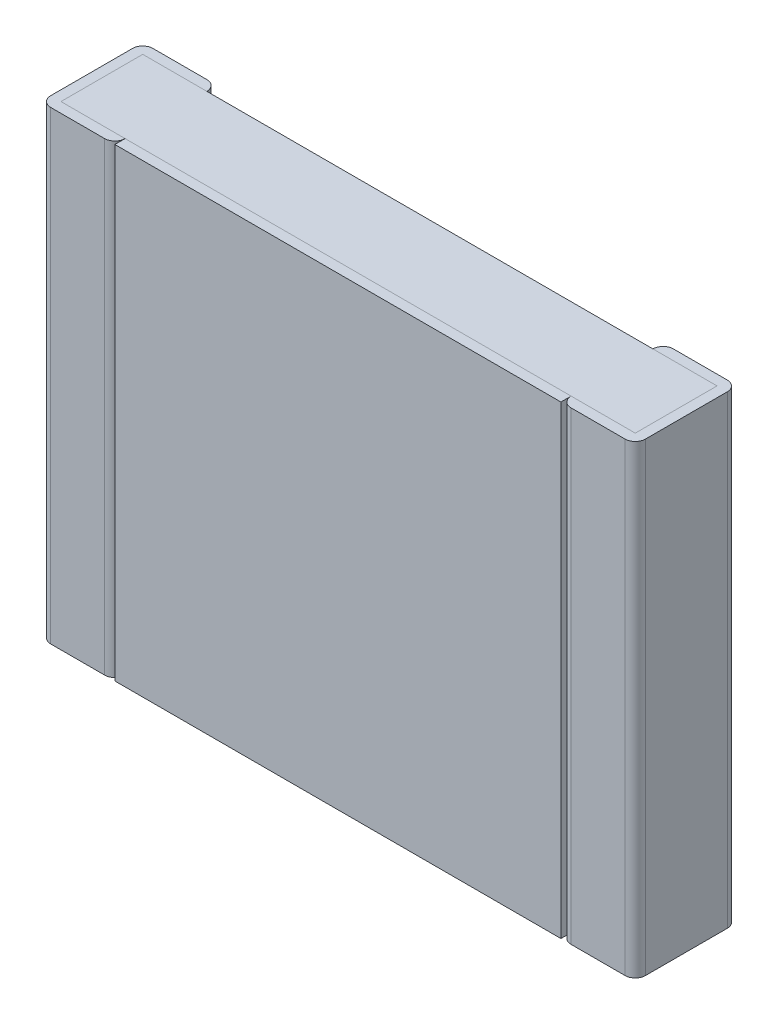
ISO-10303-21;
HEADER;
FILE_DESCRIPTION(('STEP AP214'),'2;1');
FILE_NAME('part.step','',(''),(''),'','','');
FILE_SCHEMA(('AUTOMOTIVE_DESIGN { 1 0 10303 214 1 1 1 1 }'));
ENDSEC;
DATA;
#1=APPLICATION_CONTEXT('core data for automotive mechanical design processes');
#2=APPLICATION_PROTOCOL_DEFINITION('international standard','automotive_design',2000,#1);
#3=PRODUCT_CONTEXT('',#1,'mechanical');
#4=PRODUCT('Part','Part','',(#3));
#5=PRODUCT_RELATED_PRODUCT_CATEGORY('part','',(#4));
#6=PRODUCT_DEFINITION_FORMATION('','',#4);
#7=PRODUCT_DEFINITION_CONTEXT('part definition',#1,'design');
#8=PRODUCT_DEFINITION('design','',#6,#7);
#9=PRODUCT_DEFINITION_SHAPE('','',#8);
#10=(LENGTH_UNIT() NAMED_UNIT(*) SI_UNIT(.MILLI.,.METRE.));
#11=(NAMED_UNIT(*) PLANE_ANGLE_UNIT() SI_UNIT($,.RADIAN.));
#12=(NAMED_UNIT(*) SI_UNIT($,.STERADIAN.) SOLID_ANGLE_UNIT());
#13=UNCERTAINTY_MEASURE_WITH_UNIT(LENGTH_MEASURE(1.E-05),#10,'distance_accuracy_value','');
#14=(GEOMETRIC_REPRESENTATION_CONTEXT(3) GLOBAL_UNCERTAINTY_ASSIGNED_CONTEXT((#13)) GLOBAL_UNIT_ASSIGNED_CONTEXT((#10,
#11,#12)) REPRESENTATION_CONTEXT('',''));
#15=CARTESIAN_POINT('',(0.,0.,0.));
#16=DIRECTION('',(0.,0.,1.));
#17=DIRECTION('',(1.,0.,0.));
#18=AXIS2_PLACEMENT_3D('',#15,#16,#17);
#19=CARTESIAN_POINT('',(-1.2,-1.25,0.55));
#20=DIRECTION('',(0.,0.,1.));
#21=DIRECTION('',(1.,0.,0.));
#22=AXIS2_PLACEMENT_3D('',#19,#20,#21);
#23=PLANE('',#22);
#24=DIRECTION('',(0.,1.,0.));
#25=VECTOR('',#24,1.);
#26=CARTESIAN_POINT('',(-1.2,-1.25,0.55));
#27=LINE('',#26,#25);
#28=CARTESIAN_POINT('',(-1.2,-1.25,0.55));
#29=VERTEX_POINT('',#28);
#30=CARTESIAN_POINT('',(-1.2,1.25,0.55));
#31=VERTEX_POINT('',#30);
#32=EDGE_CURVE('E357',#29,#31,#27,.T.);
#33=ORIENTED_EDGE('',*,*,#32,.F.);
#34=DIRECTION('',(1.,0.,0.));
#35=VECTOR('',#34,1.);
#36=CARTESIAN_POINT('',(-1.2,-1.25,0.55));
#37=LINE('',#36,#35);
#38=CARTESIAN_POINT('',(1.2,-1.25,0.55));
#39=VERTEX_POINT('',#38);
#40=EDGE_CURVE('E365',#29,#39,#37,.T.);
#41=ORIENTED_EDGE('',*,*,#40,.T.);
#42=DIRECTION('',(0.,1.,0.));
#43=VECTOR('',#42,1.);
#44=CARTESIAN_POINT('',(1.2,-1.25,0.55));
#45=LINE('',#44,#43);
#46=CARTESIAN_POINT('',(1.2,1.25,0.55));
#47=VERTEX_POINT('',#46);
#48=EDGE_CURVE('E11',#39,#47,#45,.T.);
#49=ORIENTED_EDGE('',*,*,#48,.T.);
#50=DIRECTION('',(1.,0.,0.));
#51=VECTOR('',#50,1.);
#52=CARTESIAN_POINT('',(-1.2,1.25,0.55));
#53=LINE('',#52,#51);
#54=EDGE_CURVE('E346',#31,#47,#53,.T.);
#55=ORIENTED_EDGE('',*,*,#54,.F.);
#56=EDGE_LOOP('',(#33,#41,#49,#55));
#57=FACE_BOUND('',#56,.T.);
#58=ADVANCED_FACE('F16',(#57),#23,.T.);
#59=CARTESIAN_POINT('',(1.2,-1.25,0.495));
#60=DIRECTION('',(1.,0.,0.));
#61=DIRECTION('',(0.,1.,0.));
#62=AXIS2_PLACEMENT_3D('',#59,#60,#61);
#63=PLANE('',#62);
#64=DIRECTION('',(0.,0.,1.));
#65=VECTOR('',#64,1.);
#66=CARTESIAN_POINT('',(1.2,-1.25,0.495));
#67=LINE('',#66,#65);
#68=CARTESIAN_POINT('',(1.2,-1.25,0.495));
#69=VERTEX_POINT('',#68);
#70=EDGE_CURVE('E361',#69,#39,#67,.T.);
#71=ORIENTED_EDGE('',*,*,#70,.F.);
#72=DIRECTION('',(0.,1.,0.));
#73=VECTOR('',#72,1.);
#74=CARTESIAN_POINT('',(1.2,-1.25,0.495));
#75=LINE('',#74,#73);
#76=CARTESIAN_POINT('',(1.2,1.25,0.495));
#77=VERTEX_POINT('',#76);
#78=EDGE_CURVE('E27',#69,#77,#75,.T.);
#79=ORIENTED_EDGE('',*,*,#78,.T.);
#80=DIRECTION('',(0.,0.,1.));
#81=VECTOR('',#80,1.);
#82=CARTESIAN_POINT('',(1.2,1.25,0.495));
#83=LINE('',#82,#81);
#84=EDGE_CURVE('E350',#77,#47,#83,.T.);
#85=ORIENTED_EDGE('',*,*,#84,.T.);
#86=ORIENTED_EDGE('',*,*,#48,.F.);
#87=EDGE_LOOP('',(#71,#79,#85,#86));
#88=FACE_BOUND('',#87,.T.);
#89=ADVANCED_FACE('F511',(#88),#63,.T.);
#90=CARTESIAN_POINT('',(1.255,-1.25,0.495));
#91=DIRECTION('',(0.,1.,0.));
#92=DIRECTION('',(-1.,0.,0.));
#93=AXIS2_PLACEMENT_3D('',#90,#91,#92);
#94=CYLINDRICAL_SURFACE('',#93,0.055);
#95=CARTESIAN_POINT('',(1.255,-1.25,0.495));
#96=DIRECTION('',(0.,1.,0.));
#97=DIRECTION('',(0.,0.,1.));
#98=AXIS2_PLACEMENT_3D('',#95,#96,#97);
#99=CIRCLE('',#98,0.055);
#100=CARTESIAN_POINT('',(1.255,-1.25,0.55));
#101=VERTEX_POINT('',#100);
#102=EDGE_CURVE('E247',#69,#101,#99,.T.);
#103=ORIENTED_EDGE('',*,*,#102,.T.);
#104=DIRECTION('',(0.,1.,0.));
#105=VECTOR('',#104,1.);
#106=CARTESIAN_POINT('',(1.255,-1.25,0.55));
#107=LINE('',#106,#105);
#108=CARTESIAN_POINT('',(1.255,1.25,0.55));
#109=VERTEX_POINT('',#108);
#110=EDGE_CURVE('E241',#101,#109,#107,.T.);
#111=ORIENTED_EDGE('',*,*,#110,.T.);
#112=CARTESIAN_POINT('',(1.255,1.25,0.495));
#113=DIRECTION('',(0.,1.,0.));
#114=DIRECTION('',(0.,0.,1.));
#115=AXIS2_PLACEMENT_3D('',#112,#113,#114);
#116=CIRCLE('',#115,0.055);
#117=EDGE_CURVE('E259',#77,#109,#116,.T.);
#118=ORIENTED_EDGE('',*,*,#117,.F.);
#119=ORIENTED_EDGE('',*,*,#78,.F.);
#120=EDGE_LOOP('',(#103,#111,#118,#119));
#121=FACE_BOUND('',#120,.T.);
#122=ADVANCED_FACE('F18',(#121),#94,.T.);
#123=CARTESIAN_POINT('',(1.2,-1.25,0.55));
#124=DIRECTION('',(0.,0.,1.));
#125=DIRECTION('',(1.,0.,0.));
#126=AXIS2_PLACEMENT_3D('',#123,#124,#125);
#127=PLANE('',#126);
#128=DIRECTION('',(1.,0.,0.));
#129=VECTOR('',#128,1.);
#130=CARTESIAN_POINT('',(1.2,1.25,0.55));
#131=LINE('',#130,#129);
#132=CARTESIAN_POINT('',(1.545,1.25,0.55));
#133=VERTEX_POINT('',#132);
#134=EDGE_CURVE('E255',#109,#133,#131,.T.);
#135=ORIENTED_EDGE('',*,*,#134,.F.);
#136=ORIENTED_EDGE('',*,*,#110,.F.);
#137=DIRECTION('',(1.,0.,0.));
#138=VECTOR('',#137,1.);
#139=CARTESIAN_POINT('',(1.2,-1.25,0.55));
#140=LINE('',#139,#138);
#141=CARTESIAN_POINT('',(1.545,-1.25,0.55));
#142=VERTEX_POINT('',#141);
#143=EDGE_CURVE('E243',#101,#142,#140,.T.);
#144=ORIENTED_EDGE('',*,*,#143,.T.);
#145=DIRECTION('',(0.,1.,0.));
#146=VECTOR('',#145,1.);
#147=CARTESIAN_POINT('',(1.545,-1.25,0.55));
#148=LINE('',#147,#146);
#149=EDGE_CURVE('E262',#142,#133,#148,.T.);
#150=ORIENTED_EDGE('',*,*,#149,.T.);
#151=EDGE_LOOP('',(#135,#136,#144,#150));
#152=FACE_BOUND('',#151,.T.);
#153=ADVANCED_FACE('F510',(#152),#127,.T.);
#154=CARTESIAN_POINT('',(1.545,-1.25,0.495));
#155=DIRECTION('',(0.,1.,0.));
#156=DIRECTION('',(1.,0.,0.));
#157=AXIS2_PLACEMENT_3D('',#154,#155,#156);
#158=CYLINDRICAL_SURFACE('',#157,0.055);
#159=DIRECTION('',(0.,1.,0.));
#160=VECTOR('',#159,1.);
#161=CARTESIAN_POINT('',(1.6,-1.25,0.495));
#162=LINE('',#161,#160);
#163=CARTESIAN_POINT('',(1.6,-1.25,0.495));
#164=VERTEX_POINT('',#163);
#165=CARTESIAN_POINT('',(1.6,1.25,0.495));
#166=VERTEX_POINT('',#165);
#167=EDGE_CURVE('E353',#164,#166,#162,.T.);
#168=ORIENTED_EDGE('',*,*,#167,.T.);
#169=CARTESIAN_POINT('',(1.545,1.25,0.495));
#170=DIRECTION('',(0.,-1.,0.));
#171=DIRECTION('',(0.,0.,1.));
#172=AXIS2_PLACEMENT_3D('',#169,#170,#171);
#173=CIRCLE('',#172,0.055);
#174=EDGE_CURVE('E233',#166,#133,#173,.T.);
#175=ORIENTED_EDGE('',*,*,#174,.T.);
#176=ORIENTED_EDGE('',*,*,#149,.F.);
#177=CARTESIAN_POINT('',(1.545,-1.25,0.495));
#178=DIRECTION('',(0.,-1.,0.));
#179=DIRECTION('',(0.,0.,1.));
#180=AXIS2_PLACEMENT_3D('',#177,#178,#179);
#181=CIRCLE('',#180,0.055);
#182=EDGE_CURVE('E248',#164,#142,#181,.T.);
#183=ORIENTED_EDGE('',*,*,#182,.F.);
#184=EDGE_LOOP('',(#168,#175,#176,#183));
#185=FACE_BOUND('',#184,.T.);
#186=ADVANCED_FACE('F535',(#185),#158,.T.);
#187=CARTESIAN_POINT('',(1.6,-1.25,0.));
#188=DIRECTION('',(1.,0.,0.));
#189=DIRECTION('',(0.,1.,0.));
#190=AXIS2_PLACEMENT_3D('',#187,#188,#189);
#191=PLANE('',#190);
#192=DIRECTION('',(0.,0.,1.));
#193=VECTOR('',#192,1.);
#194=CARTESIAN_POINT('',(1.6,-1.25,0.));
#195=LINE('',#194,#193);
#196=CARTESIAN_POINT('',(1.6,-1.25,0.055));
#197=VERTEX_POINT('',#196);
#198=EDGE_CURVE('E321',#197,#164,#195,.T.);
#199=ORIENTED_EDGE('',*,*,#198,.F.);
#200=DIRECTION('',(0.,1.,0.));
#201=VECTOR('',#200,1.);
#202=CARTESIAN_POINT('',(1.6,-1.25,0.055));
#203=LINE('',#202,#201);
#204=CARTESIAN_POINT('',(1.6,1.25,0.055));
#205=VERTEX_POINT('',#204);
#206=EDGE_CURVE('E289',#197,#205,#203,.T.);
#207=ORIENTED_EDGE('',*,*,#206,.T.);
#208=DIRECTION('',(0.,0.,1.));
#209=VECTOR('',#208,1.);
#210=CARTESIAN_POINT('',(1.6,1.25,0.));
#211=LINE('',#210,#209);
#212=EDGE_CURVE('E228',#205,#166,#211,.T.);
#213=ORIENTED_EDGE('',*,*,#212,.T.);
#214=ORIENTED_EDGE('',*,*,#167,.F.);
#215=EDGE_LOOP('',(#199,#207,#213,#214));
#216=FACE_BOUND('',#215,.T.);
#217=ADVANCED_FACE('F540',(#216),#191,.T.);
#218=CARTESIAN_POINT('',(1.545,-1.25,0.055));
#219=DIRECTION('',(0.,1.,0.));
#220=DIRECTION('',(1.,0.,0.));
#221=AXIS2_PLACEMENT_3D('',#218,#219,#220);
#222=CYLINDRICAL_SURFACE('',#221,0.055);
#223=CARTESIAN_POINT('',(1.545,-1.25,0.055));
#224=DIRECTION('',(0.,1.,0.));
#225=DIRECTION('',(0.,0.,1.));
#226=AXIS2_PLACEMENT_3D('',#223,#224,#225);
#227=CIRCLE('',#226,0.055);
#228=CARTESIAN_POINT('',(1.545,-1.25,0.));
#229=VERTEX_POINT('',#228);
#230=EDGE_CURVE('E325',#197,#229,#227,.T.);
#231=ORIENTED_EDGE('',*,*,#230,.T.);
#232=DIRECTION('',(0.,1.,0.));
#233=VECTOR('',#232,1.);
#234=CARTESIAN_POINT('',(1.545,-1.25,0.));
#235=LINE('',#234,#233);
#236=CARTESIAN_POINT('',(1.545,1.25,0.));
#237=VERTEX_POINT('',#236);
#238=EDGE_CURVE('E286',#229,#237,#235,.T.);
#239=ORIENTED_EDGE('',*,*,#238,.T.);
#240=CARTESIAN_POINT('',(1.545,1.25,0.055));
#241=DIRECTION('',(0.,1.,0.));
#242=DIRECTION('',(0.,0.,1.));
#243=AXIS2_PLACEMENT_3D('',#240,#241,#242);
#244=CIRCLE('',#243,0.055);
#245=EDGE_CURVE('E232',#205,#237,#244,.T.);
#246=ORIENTED_EDGE('',*,*,#245,.F.);
#247=ORIENTED_EDGE('',*,*,#206,.F.);
#248=EDGE_LOOP('',(#231,#239,#246,#247));
#249=FACE_BOUND('',#248,.T.);
#250=ADVANCED_FACE('F578',(#249),#222,.T.);
#251=CARTESIAN_POINT('',(1.2,-1.25,0.));
#252=DIRECTION('',(0.,0.,1.));
#253=DIRECTION('',(1.,0.,0.));
#254=AXIS2_PLACEMENT_3D('',#251,#252,#253);
#255=PLANE('',#254);
#256=ORIENTED_EDGE('',*,*,#238,.F.);
#257=DIRECTION('',(1.,0.,0.));
#258=VECTOR('',#257,1.);
#259=CARTESIAN_POINT('',(1.2,-1.25,0.));
#260=LINE('',#259,#258);
#261=CARTESIAN_POINT('',(1.255,-1.25,0.));
#262=VERTEX_POINT('',#261);
#263=EDGE_CURVE('E221',#262,#229,#260,.T.);
#264=ORIENTED_EDGE('',*,*,#263,.F.);
#265=DIRECTION('',(0.,1.,0.));
#266=VECTOR('',#265,1.);
#267=CARTESIAN_POINT('',(1.255,-1.25,0.));
#268=LINE('',#267,#266);
#269=CARTESIAN_POINT('',(1.255,1.25,0.));
#270=VERTEX_POINT('',#269);
#271=EDGE_CURVE('E290',#262,#270,#268,.T.);
#272=ORIENTED_EDGE('',*,*,#271,.T.);
#273=DIRECTION('',(1.,0.,0.));
#274=VECTOR('',#273,1.);
#275=CARTESIAN_POINT('',(1.2,1.25,0.));
#276=LINE('',#275,#274);
#277=EDGE_CURVE('E310',#270,#237,#276,.T.);
#278=ORIENTED_EDGE('',*,*,#277,.T.);
#279=EDGE_LOOP('',(#256,#264,#272,#278));
#280=FACE_BOUND('',#279,.T.);
#281=ADVANCED_FACE('F573',(#280),#255,.F.);
#282=CARTESIAN_POINT('',(1.255,-1.25,0.055));
#283=DIRECTION('',(0.,1.,0.));
#284=DIRECTION('',(-1.,0.,0.));
#285=AXIS2_PLACEMENT_3D('',#282,#283,#284);
#286=CYLINDRICAL_SURFACE('',#285,0.055);
#287=DIRECTION('',(0.,1.,0.));
#288=VECTOR('',#287,1.);
#289=CARTESIAN_POINT('',(1.2,-1.25,0.055));
#290=LINE('',#289,#288);
#291=CARTESIAN_POINT('',(1.2,-1.25,0.055));
#292=VERTEX_POINT('',#291);
#293=CARTESIAN_POINT('',(1.2,1.25,0.055));
#294=VERTEX_POINT('',#293);
#295=EDGE_CURVE('E408',#292,#294,#290,.T.);
#296=ORIENTED_EDGE('',*,*,#295,.T.);
#297=CARTESIAN_POINT('',(1.255,1.25,0.055));
#298=DIRECTION('',(0.,-1.,0.));
#299=DIRECTION('',(0.,0.,1.));
#300=AXIS2_PLACEMENT_3D('',#297,#298,#299);
#301=CIRCLE('',#300,0.055);
#302=EDGE_CURVE('E265',#294,#270,#301,.T.);
#303=ORIENTED_EDGE('',*,*,#302,.T.);
#304=ORIENTED_EDGE('',*,*,#271,.F.);
#305=CARTESIAN_POINT('',(1.255,-1.25,0.055));
#306=DIRECTION('',(0.,-1.,0.));
#307=DIRECTION('',(0.,0.,1.));
#308=AXIS2_PLACEMENT_3D('',#305,#306,#307);
#309=CIRCLE('',#308,0.055);
#310=EDGE_CURVE('E373',#292,#262,#309,.T.);
#311=ORIENTED_EDGE('',*,*,#310,.F.);
#312=EDGE_LOOP('',(#296,#303,#304,#311));
#313=FACE_BOUND('',#312,.T.);
#314=ADVANCED_FACE('F526',(#313),#286,.T.);
#315=CARTESIAN_POINT('',(-1.2,1.25,0.495));
#316=DIRECTION('',(0.,1.,0.));
#317=DIRECTION('',(1.,0.,0.));
#318=AXIS2_PLACEMENT_3D('',#315,#316,#317);
#319=PLANE('',#318);
#320=DIRECTION('',(1.,0.,0.));
#321=VECTOR('',#320,1.);
#322=CARTESIAN_POINT('',(-1.2,1.25,0.495));
#323=LINE('',#322,#321);
#324=CARTESIAN_POINT('',(-1.2,1.25,0.495));
#325=VERTEX_POINT('',#324);
#326=EDGE_CURVE('E210',#325,#77,#323,.T.);
#327=ORIENTED_EDGE('',*,*,#326,.F.);
#328=DIRECTION('',(0.,0.,1.));
#329=VECTOR('',#328,1.);
#330=CARTESIAN_POINT('',(-1.2,1.25,0.495));
#331=LINE('',#330,#329);
#332=EDGE_CURVE('E314',#325,#31,#331,.T.);
#333=ORIENTED_EDGE('',*,*,#332,.T.);
#334=ORIENTED_EDGE('',*,*,#54,.T.);
#335=ORIENTED_EDGE('',*,*,#84,.F.);
#336=EDGE_LOOP('',(#327,#333,#334,#335));
#337=FACE_BOUND('',#336,.T.);
#338=ADVANCED_FACE('F521',(#337),#319,.T.);
#339=CARTESIAN_POINT('',(1.2,1.25,0.));
#340=DIRECTION('',(0.,1.,0.));
#341=DIRECTION('',(1.,0.,0.));
#342=AXIS2_PLACEMENT_3D('',#339,#340,#341);
#343=PLANE('',#342);
#344=ORIENTED_EDGE('',*,*,#277,.F.);
#345=ORIENTED_EDGE('',*,*,#302,.F.);
#346=DIRECTION('',(1.,0.,0.));
#347=VECTOR('',#346,1.);
#348=CARTESIAN_POINT('',(-1.545,1.25,0.055));
#349=LINE('',#348,#347);
#350=CARTESIAN_POINT('',(1.545,1.25,0.055));
#351=VERTEX_POINT('',#350);
#352=EDGE_CURVE('E202',#294,#351,#349,.T.);
#353=ORIENTED_EDGE('',*,*,#352,.T.);
#354=DIRECTION('',(0.,0.,1.));
#355=VECTOR('',#354,1.);
#356=CARTESIAN_POINT('',(1.545,1.25,0.055));
#357=LINE('',#356,#355);
#358=CARTESIAN_POINT('',(1.545,1.25,0.495));
#359=VERTEX_POINT('',#358);
#360=EDGE_CURVE('E193',#351,#359,#357,.T.);
#361=ORIENTED_EDGE('',*,*,#360,.T.);
#362=DIRECTION('',(1.,0.,0.));
#363=VECTOR('',#362,1.);
#364=CARTESIAN_POINT('',(-1.545,1.25,0.495));
#365=LINE('',#364,#363);
#366=EDGE_CURVE('E198',#77,#359,#365,.T.);
#367=ORIENTED_EDGE('',*,*,#366,.F.);
#368=ORIENTED_EDGE('',*,*,#117,.T.);
#369=ORIENTED_EDGE('',*,*,#134,.T.);
#370=ORIENTED_EDGE('',*,*,#174,.F.);
#371=ORIENTED_EDGE('',*,*,#212,.F.);
#372=ORIENTED_EDGE('',*,*,#245,.T.);
#373=EDGE_LOOP('',(#344,#345,#353,#361,#367,#368,#369,#370,#371,#372));
#374=FACE_BOUND('',#373,.T.);
#375=ADVANCED_FACE('F196',(#374),#343,.T.);
#376=CARTESIAN_POINT('',(-1.2,-1.25,0.495));
#377=DIRECTION('',(1.,0.,0.));
#378=DIRECTION('',(0.,1.,0.));
#379=AXIS2_PLACEMENT_3D('',#376,#377,#378);
#380=PLANE('',#379);
#381=ORIENTED_EDGE('',*,*,#32,.T.);
#382=ORIENTED_EDGE('',*,*,#332,.F.);
#383=DIRECTION('',(0.,1.,0.));
#384=VECTOR('',#383,1.);
#385=CARTESIAN_POINT('',(-1.2,-1.25,0.495));
#386=LINE('',#385,#384);
#387=CARTESIAN_POINT('',(-1.2,-1.25,0.495));
#388=VERTEX_POINT('',#387);
#389=EDGE_CURVE('E217',#388,#325,#386,.T.);
#390=ORIENTED_EDGE('',*,*,#389,.F.);
#391=DIRECTION('',(0.,0.,1.));
#392=VECTOR('',#391,1.);
#393=CARTESIAN_POINT('',(-1.2,-1.25,0.495));
#394=LINE('',#393,#392);
#395=EDGE_CURVE('E411',#388,#29,#394,.T.);
#396=ORIENTED_EDGE('',*,*,#395,.T.);
#397=EDGE_LOOP('',(#381,#382,#390,#396));
#398=FACE_BOUND('',#397,.T.);
#399=ADVANCED_FACE('F551',(#398),#380,.F.);
#400=CARTESIAN_POINT('',(-1.2,-1.25,0.495));
#401=DIRECTION('',(0.,1.,0.));
#402=DIRECTION('',(1.,0.,0.));
#403=AXIS2_PLACEMENT_3D('',#400,#401,#402);
#404=PLANE('',#403);
#405=ORIENTED_EDGE('',*,*,#70,.T.);
#406=ORIENTED_EDGE('',*,*,#40,.F.);
#407=ORIENTED_EDGE('',*,*,#395,.F.);
#408=DIRECTION('',(1.,0.,0.));
#409=VECTOR('',#408,1.);
#410=CARTESIAN_POINT('',(-1.2,-1.25,0.495));
#411=LINE('',#410,#409);
#412=EDGE_CURVE('E276',#388,#69,#411,.T.);
#413=ORIENTED_EDGE('',*,*,#412,.T.);
#414=EDGE_LOOP('',(#405,#406,#407,#413));
#415=FACE_BOUND('',#414,.T.);
#416=ADVANCED_FACE('F585',(#415),#404,.F.);
#417=CARTESIAN_POINT('',(1.2,-1.25,0.));
#418=DIRECTION('',(0.,1.,0.));
#419=DIRECTION('',(1.,0.,0.));
#420=AXIS2_PLACEMENT_3D('',#417,#418,#419);
#421=PLANE('',#420);
#422=ORIENTED_EDGE('',*,*,#230,.F.);
#423=ORIENTED_EDGE('',*,*,#198,.T.);
#424=ORIENTED_EDGE('',*,*,#182,.T.);
#425=ORIENTED_EDGE('',*,*,#143,.F.);
#426=ORIENTED_EDGE('',*,*,#102,.F.);
#427=DIRECTION('',(1.,0.,0.));
#428=VECTOR('',#427,1.);
#429=CARTESIAN_POINT('',(-1.545,-1.25,0.495));
#430=LINE('',#429,#428);
#431=CARTESIAN_POINT('',(1.545,-1.25,0.495));
#432=VERTEX_POINT('',#431);
#433=EDGE_CURVE('E281',#69,#432,#430,.T.);
#434=ORIENTED_EDGE('',*,*,#433,.T.);
#435=DIRECTION('',(0.,0.,1.));
#436=VECTOR('',#435,1.);
#437=CARTESIAN_POINT('',(1.545,-1.25,0.055));
#438=LINE('',#437,#436);
#439=CARTESIAN_POINT('',(1.545,-1.25,0.055));
#440=VERTEX_POINT('',#439);
#441=EDGE_CURVE('E366',#440,#432,#438,.T.);
#442=ORIENTED_EDGE('',*,*,#441,.F.);
#443=DIRECTION('',(1.,0.,0.));
#444=VECTOR('',#443,1.);
#445=CARTESIAN_POINT('',(-1.545,-1.25,0.055));
#446=LINE('',#445,#444);
#447=EDGE_CURVE('E300',#292,#440,#446,.T.);
#448=ORIENTED_EDGE('',*,*,#447,.F.);
#449=ORIENTED_EDGE('',*,*,#310,.T.);
#450=ORIENTED_EDGE('',*,*,#263,.T.);
#451=EDGE_LOOP('',(#422,#423,#424,#425,#426,#434,#442,#448,#449,#450));
#452=FACE_BOUND('',#451,.T.);
#453=ADVANCED_FACE('F590',(#452),#421,.F.);
#454=CARTESIAN_POINT('',(-1.545,-1.25,0.055));
#455=DIRECTION('',(0.,0.,1.));
#456=DIRECTION('',(1.,0.,0.));
#457=AXIS2_PLACEMENT_3D('',#454,#455,#456);
#458=PLANE('',#457);
#459=DIRECTION('',(1.,0.,0.));
#460=VECTOR('',#459,1.);
#461=CARTESIAN_POINT('',(-1.545,1.25,0.055));
#462=LINE('',#461,#460);
#463=CARTESIAN_POINT('',(-1.2,1.25,0.055));
#464=VERTEX_POINT('',#463);
#465=EDGE_CURVE('E304',#464,#294,#462,.T.);
#466=ORIENTED_EDGE('',*,*,#465,.T.);
#467=ORIENTED_EDGE('',*,*,#295,.F.);
#468=DIRECTION('',(1.,0.,0.));
#469=VECTOR('',#468,1.);
#470=CARTESIAN_POINT('',(-1.545,-1.25,0.055));
#471=LINE('',#470,#469);
#472=CARTESIAN_POINT('',(-1.2,-1.25,0.055));
#473=VERTEX_POINT('',#472);
#474=EDGE_CURVE('E296',#473,#292,#471,.T.);
#475=ORIENTED_EDGE('',*,*,#474,.F.);
#476=DIRECTION('',(0.,1.,0.));
#477=VECTOR('',#476,1.);
#478=CARTESIAN_POINT('',(-1.2,-1.25,0.055));
#479=LINE('',#478,#477);
#480=EDGE_CURVE('E301',#473,#464,#479,.T.);
#481=ORIENTED_EDGE('',*,*,#480,.T.);
#482=EDGE_LOOP('',(#466,#467,#475,#481));
#483=FACE_BOUND('',#482,.T.);
#484=ADVANCED_FACE('F720',(#483),#458,.F.);
#485=CARTESIAN_POINT('',(-1.545,1.25,0.055));
#486=DIRECTION('',(0.,1.,0.));
#487=DIRECTION('',(1.,0.,0.));
#488=AXIS2_PLACEMENT_3D('',#485,#486,#487);
#489=PLANE('',#488);
#490=DIRECTION('',(1.,0.,0.));
#491=VECTOR('',#490,1.);
#492=CARTESIAN_POINT('',(-1.545,1.25,0.055));
#493=LINE('',#492,#491);
#494=CARTESIAN_POINT('',(-1.545,1.25,0.055));
#495=VERTEX_POINT('',#494);
#496=EDGE_CURVE('E372',#495,#464,#493,.T.);
#497=ORIENTED_EDGE('',*,*,#496,.F.);
#498=DIRECTION('',(0.,0.,1.));
#499=VECTOR('',#498,1.);
#500=CARTESIAN_POINT('',(-1.545,1.25,0.055));
#501=LINE('',#500,#499);
#502=CARTESIAN_POINT('',(-1.545,1.25,0.495));
#503=VERTEX_POINT('',#502);
#504=EDGE_CURVE('E269',#495,#503,#501,.T.);
#505=ORIENTED_EDGE('',*,*,#504,.T.);
#506=DIRECTION('',(1.,0.,0.));
#507=VECTOR('',#506,1.);
#508=CARTESIAN_POINT('',(-1.545,1.25,0.495));
#509=LINE('',#508,#507);
#510=EDGE_CURVE('E266',#503,#325,#509,.T.);
#511=ORIENTED_EDGE('',*,*,#510,.T.);
#512=ORIENTED_EDGE('',*,*,#326,.T.);
#513=ORIENTED_EDGE('',*,*,#366,.T.);
#514=ORIENTED_EDGE('',*,*,#360,.F.);
#515=ORIENTED_EDGE('',*,*,#352,.F.);
#516=ORIENTED_EDGE('',*,*,#465,.F.);
#517=EDGE_LOOP('',(#497,#505,#511,#512,#513,#514,#515,#516));
#518=FACE_BOUND('',#517,.T.);
#519=ADVANCED_FACE('F207',(#518),#489,.T.);
#520=CARTESIAN_POINT('',(-1.255,-1.25,0.495));
#521=DIRECTION('',(0.,1.,0.));
#522=DIRECTION('',(1.,0.,0.));
#523=AXIS2_PLACEMENT_3D('',#520,#521,#522);
#524=CYLINDRICAL_SURFACE('',#523,0.055);
#525=ORIENTED_EDGE('',*,*,#389,.T.);
#526=CARTESIAN_POINT('',(-1.255,1.25,0.495));
#527=DIRECTION('',(0.,-1.,0.));
#528=DIRECTION('',(0.,0.,1.));
#529=AXIS2_PLACEMENT_3D('',#526,#527,#528);
#530=CIRCLE('',#529,0.055);
#531=CARTESIAN_POINT('',(-1.255,1.25,0.55));
#532=VERTEX_POINT('',#531);
#533=EDGE_CURVE('E226',#325,#532,#530,.T.);
#534=ORIENTED_EDGE('',*,*,#533,.T.);
#535=DIRECTION('',(0.,1.,0.));
#536=VECTOR('',#535,1.);
#537=CARTESIAN_POINT('',(-1.255,-1.25,0.55));
#538=LINE('',#537,#536);
#539=CARTESIAN_POINT('',(-1.255,-1.25,0.55));
#540=VERTEX_POINT('',#539);
#541=EDGE_CURVE('E280',#540,#532,#538,.T.);
#542=ORIENTED_EDGE('',*,*,#541,.F.);
#543=CARTESIAN_POINT('',(-1.255,-1.25,0.495));
#544=DIRECTION('',(0.,-1.,0.));
#545=DIRECTION('',(0.,0.,1.));
#546=AXIS2_PLACEMENT_3D('',#543,#544,#545);
#547=CIRCLE('',#546,0.055);
#548=EDGE_CURVE('E270',#388,#540,#547,.T.);
#549=ORIENTED_EDGE('',*,*,#548,.F.);
#550=EDGE_LOOP('',(#525,#534,#542,#549));
#551=FACE_BOUND('',#550,.T.);
#552=ADVANCED_FACE('F481',(#551),#524,.T.);
#553=CARTESIAN_POINT('',(-1.6,-1.25,0.55));
#554=DIRECTION('',(0.,0.,1.));
#555=DIRECTION('',(1.,0.,0.));
#556=AXIS2_PLACEMENT_3D('',#553,#554,#555);
#557=PLANE('',#556);
#558=DIRECTION('',(1.,0.,0.));
#559=VECTOR('',#558,1.);
#560=CARTESIAN_POINT('',(-1.6,1.25,0.55));
#561=LINE('',#560,#559);
#562=CARTESIAN_POINT('',(-1.545,1.25,0.55));
#563=VERTEX_POINT('',#562);
#564=EDGE_CURVE('E223',#563,#532,#561,.T.);
#565=ORIENTED_EDGE('',*,*,#564,.F.);
#566=DIRECTION('',(0.,1.,0.));
#567=VECTOR('',#566,1.);
#568=CARTESIAN_POINT('',(-1.545,-1.25,0.55));
#569=LINE('',#568,#567);
#570=CARTESIAN_POINT('',(-1.545,-1.25,0.55));
#571=VERTEX_POINT('',#570);
#572=EDGE_CURVE('E234',#571,#563,#569,.T.);
#573=ORIENTED_EDGE('',*,*,#572,.F.);
#574=DIRECTION('',(1.,0.,0.));
#575=VECTOR('',#574,1.);
#576=CARTESIAN_POINT('',(-1.6,-1.25,0.55));
#577=LINE('',#576,#575);
#578=EDGE_CURVE('E274',#571,#540,#577,.T.);
#579=ORIENTED_EDGE('',*,*,#578,.T.);
#580=ORIENTED_EDGE('',*,*,#541,.T.);
#581=EDGE_LOOP('',(#565,#573,#579,#580));
#582=FACE_BOUND('',#581,.T.);
#583=ADVANCED_FACE('F476',(#582),#557,.T.);
#584=CARTESIAN_POINT('',(-1.545,-1.25,0.055));
#585=DIRECTION('',(0.,1.,0.));
#586=DIRECTION('',(1.,0.,0.));
#587=AXIS2_PLACEMENT_3D('',#584,#585,#586);
#588=PLANE('',#587);
#589=ORIENTED_EDGE('',*,*,#474,.T.);
#590=ORIENTED_EDGE('',*,*,#447,.T.);
#591=ORIENTED_EDGE('',*,*,#441,.T.);
#592=ORIENTED_EDGE('',*,*,#433,.F.);
#593=ORIENTED_EDGE('',*,*,#412,.F.);
#594=DIRECTION('',(1.,0.,0.));
#595=VECTOR('',#594,1.);
#596=CARTESIAN_POINT('',(-1.545,-1.25,0.495));
#597=LINE('',#596,#595);
#598=CARTESIAN_POINT('',(-1.545,-1.25,0.495));
#599=VERTEX_POINT('',#598);
#600=EDGE_CURVE('E275',#599,#388,#597,.T.);
#601=ORIENTED_EDGE('',*,*,#600,.F.);
#602=DIRECTION('',(0.,0.,1.));
#603=VECTOR('',#602,1.);
#604=CARTESIAN_POINT('',(-1.545,-1.25,0.055));
#605=LINE('',#604,#603);
#606=CARTESIAN_POINT('',(-1.545,-1.25,0.055));
#607=VERTEX_POINT('',#606);
#608=EDGE_CURVE('E319',#607,#599,#605,.T.);
#609=ORIENTED_EDGE('',*,*,#608,.F.);
#610=DIRECTION('',(1.,0.,0.));
#611=VECTOR('',#610,1.);
#612=CARTESIAN_POINT('',(-1.545,-1.25,0.055));
#613=LINE('',#612,#611);
#614=EDGE_CURVE('E315',#607,#473,#613,.T.);
#615=ORIENTED_EDGE('',*,*,#614,.T.);
#616=EDGE_LOOP('',(#589,#590,#591,#592,#593,#601,#609,#615));
#617=FACE_BOUND('',#616,.T.);
#618=ADVANCED_FACE('F564',(#617),#588,.F.);
#619=CARTESIAN_POINT('',(-1.255,-1.25,0.055));
#620=DIRECTION('',(0.,1.,0.));
#621=DIRECTION('',(1.,0.,0.));
#622=AXIS2_PLACEMENT_3D('',#619,#620,#621);
#623=CYLINDRICAL_SURFACE('',#622,0.055);
#624=CARTESIAN_POINT('',(-1.255,-1.25,0.055));
#625=DIRECTION('',(0.,1.,0.));
#626=DIRECTION('',(0.,0.,1.));
#627=AXIS2_PLACEMENT_3D('',#624,#625,#626);
#628=CIRCLE('',#627,0.055);
#629=CARTESIAN_POINT('',(-1.255,-1.25,0.));
#630=VERTEX_POINT('',#629);
#631=EDGE_CURVE('E320',#473,#630,#628,.T.);
#632=ORIENTED_EDGE('',*,*,#631,.T.);
#633=DIRECTION('',(0.,1.,0.));
#634=VECTOR('',#633,1.);
#635=CARTESIAN_POINT('',(-1.255,-1.25,0.));
#636=LINE('',#635,#634);
#637=CARTESIAN_POINT('',(-1.255,1.25,0.));
#638=VERTEX_POINT('',#637);
#639=EDGE_CURVE('E339',#630,#638,#636,.T.);
#640=ORIENTED_EDGE('',*,*,#639,.T.);
#641=CARTESIAN_POINT('',(-1.255,1.25,0.055));
#642=DIRECTION('',(0.,1.,0.));
#643=DIRECTION('',(0.,0.,1.));
#644=AXIS2_PLACEMENT_3D('',#641,#642,#643);
#645=CIRCLE('',#644,0.055);
#646=EDGE_CURVE('E457',#464,#638,#645,.T.);
#647=ORIENTED_EDGE('',*,*,#646,.F.);
#648=ORIENTED_EDGE('',*,*,#480,.F.);
#649=EDGE_LOOP('',(#632,#640,#647,#648));
#650=FACE_BOUND('',#649,.T.);
#651=ADVANCED_FACE('F558',(#650),#623,.T.);
#652=CARTESIAN_POINT('',(-1.6,-1.25,0.));
#653=DIRECTION('',(0.,0.,1.));
#654=DIRECTION('',(1.,0.,0.));
#655=AXIS2_PLACEMENT_3D('',#652,#653,#654);
#656=PLANE('',#655);
#657=ORIENTED_EDGE('',*,*,#639,.F.);
#658=DIRECTION('',(1.,0.,0.));
#659=VECTOR('',#658,1.);
#660=CARTESIAN_POINT('',(-1.6,-1.25,0.));
#661=LINE('',#660,#659);
#662=CARTESIAN_POINT('',(-1.545,-1.25,0.));
#663=VERTEX_POINT('',#662);
#664=EDGE_CURVE('E20',#663,#630,#661,.T.);
#665=ORIENTED_EDGE('',*,*,#664,.F.);
#666=DIRECTION('',(0.,1.,0.));
#667=VECTOR('',#666,1.);
#668=CARTESIAN_POINT('',(-1.545,-1.25,0.));
#669=LINE('',#668,#667);
#670=CARTESIAN_POINT('',(-1.545,1.25,0.));
#671=VERTEX_POINT('',#670);
#672=EDGE_CURVE('E239',#663,#671,#669,.T.);
#673=ORIENTED_EDGE('',*,*,#672,.T.);
#674=DIRECTION('',(1.,0.,0.));
#675=VECTOR('',#674,1.);
#676=CARTESIAN_POINT('',(-1.6,1.25,0.));
#677=LINE('',#676,#675);
#678=EDGE_CURVE('E227',#671,#638,#677,.T.);
#679=ORIENTED_EDGE('',*,*,#678,.T.);
#680=EDGE_LOOP('',(#657,#665,#673,#679));
#681=FACE_BOUND('',#680,.T.);
#682=ADVANCED_FACE('F563',(#681),#656,.F.);
#683=CARTESIAN_POINT('',(-1.6,1.25,0.));
#684=DIRECTION('',(0.,1.,0.));
#685=DIRECTION('',(1.,0.,0.));
#686=AXIS2_PLACEMENT_3D('',#683,#684,#685);
#687=PLANE('',#686);
#688=ORIENTED_EDGE('',*,*,#678,.F.);
#689=CARTESIAN_POINT('',(-1.545,1.25,0.055));
#690=DIRECTION('',(0.,-1.,0.));
#691=DIRECTION('',(0.,0.,1.));
#692=AXIS2_PLACEMENT_3D('',#689,#690,#691);
#693=CIRCLE('',#692,0.055);
#694=CARTESIAN_POINT('',(-1.6,1.25,0.055));
#695=VERTEX_POINT('',#694);
#696=EDGE_CURVE('E326',#695,#671,#693,.T.);
#697=ORIENTED_EDGE('',*,*,#696,.F.);
#698=DIRECTION('',(0.,0.,1.));
#699=VECTOR('',#698,1.);
#700=CARTESIAN_POINT('',(-1.6,1.25,0.));
#701=LINE('',#700,#699);
#702=CARTESIAN_POINT('',(-1.6,1.25,0.495));
#703=VERTEX_POINT('',#702);
#704=EDGE_CURVE('E254',#695,#703,#701,.T.);
#705=ORIENTED_EDGE('',*,*,#704,.T.);
#706=CARTESIAN_POINT('',(-1.545,1.25,0.495));
#707=DIRECTION('',(0.,1.,0.));
#708=DIRECTION('',(0.,0.,1.));
#709=AXIS2_PLACEMENT_3D('',#706,#707,#708);
#710=CIRCLE('',#709,0.055);
#711=EDGE_CURVE('E238',#703,#563,#710,.T.);
#712=ORIENTED_EDGE('',*,*,#711,.T.);
#713=ORIENTED_EDGE('',*,*,#564,.T.);
#714=ORIENTED_EDGE('',*,*,#533,.F.);
#715=ORIENTED_EDGE('',*,*,#510,.F.);
#716=ORIENTED_EDGE('',*,*,#504,.F.);
#717=ORIENTED_EDGE('',*,*,#496,.T.);
#718=ORIENTED_EDGE('',*,*,#646,.T.);
#719=EDGE_LOOP('',(#688,#697,#705,#712,#713,#714,#715,#716,#717,#718));
#720=FACE_BOUND('',#719,.T.);
#721=ADVANCED_FACE('F463',(#720),#687,.T.);
#722=CARTESIAN_POINT('',(-1.545,-1.25,0.495));
#723=DIRECTION('',(0.,1.,0.));
#724=DIRECTION('',(-1.,0.,0.));
#725=AXIS2_PLACEMENT_3D('',#722,#723,#724);
#726=CYLINDRICAL_SURFACE('',#725,0.055);
#727=CARTESIAN_POINT('',(-1.545,-1.25,0.495));
#728=DIRECTION('',(0.,1.,0.));
#729=DIRECTION('',(0.,0.,1.));
#730=AXIS2_PLACEMENT_3D('',#727,#728,#729);
#731=CIRCLE('',#730,0.055);
#732=CARTESIAN_POINT('',(-1.6,-1.25,0.495));
#733=VERTEX_POINT('',#732);
#734=EDGE_CURVE('E291',#733,#571,#731,.T.);
#735=ORIENTED_EDGE('',*,*,#734,.T.);
#736=ORIENTED_EDGE('',*,*,#572,.T.);
#737=ORIENTED_EDGE('',*,*,#711,.F.);
#738=DIRECTION('',(0.,1.,0.));
#739=VECTOR('',#738,1.);
#740=CARTESIAN_POINT('',(-1.6,-1.25,0.495));
#741=LINE('',#740,#739);
#742=EDGE_CURVE('E282',#733,#703,#741,.T.);
#743=ORIENTED_EDGE('',*,*,#742,.F.);
#744=EDGE_LOOP('',(#735,#736,#737,#743));
#745=FACE_BOUND('',#744,.T.);
#746=ADVANCED_FACE('F470',(#745),#726,.T.);
#747=CARTESIAN_POINT('',(-1.545,-1.25,0.055));
#748=DIRECTION('',(0.,1.,0.));
#749=DIRECTION('',(-1.,0.,0.));
#750=AXIS2_PLACEMENT_3D('',#747,#748,#749);
#751=CYLINDRICAL_SURFACE('',#750,0.055);
#752=DIRECTION('',(0.,1.,0.));
#753=VECTOR('',#752,1.);
#754=CARTESIAN_POINT('',(-1.6,-1.25,0.055));
#755=LINE('',#754,#753);
#756=CARTESIAN_POINT('',(-1.6,-1.25,0.055));
#757=VERTEX_POINT('',#756);
#758=EDGE_CURVE('E249',#757,#695,#755,.T.);
#759=ORIENTED_EDGE('',*,*,#758,.T.);
#760=ORIENTED_EDGE('',*,*,#696,.T.);
#761=ORIENTED_EDGE('',*,*,#672,.F.);
#762=CARTESIAN_POINT('',(-1.545,-1.25,0.055));
#763=DIRECTION('',(0.,-1.,0.));
#764=DIRECTION('',(0.,0.,1.));
#765=AXIS2_PLACEMENT_3D('',#762,#763,#764);
#766=CIRCLE('',#765,0.055);
#767=EDGE_CURVE('E295',#757,#663,#766,.T.);
#768=ORIENTED_EDGE('',*,*,#767,.F.);
#769=EDGE_LOOP('',(#759,#760,#761,#768));
#770=FACE_BOUND('',#769,.T.);
#771=ADVANCED_FACE('F604',(#770),#751,.T.);
#772=CARTESIAN_POINT('',(-1.6,-1.25,0.));
#773=DIRECTION('',(0.,1.,0.));
#774=DIRECTION('',(1.,0.,0.));
#775=AXIS2_PLACEMENT_3D('',#772,#773,#774);
#776=PLANE('',#775);
#777=ORIENTED_EDGE('',*,*,#631,.F.);
#778=ORIENTED_EDGE('',*,*,#614,.F.);
#779=ORIENTED_EDGE('',*,*,#608,.T.);
#780=ORIENTED_EDGE('',*,*,#600,.T.);
#781=ORIENTED_EDGE('',*,*,#548,.T.);
#782=ORIENTED_EDGE('',*,*,#578,.F.);
#783=ORIENTED_EDGE('',*,*,#734,.F.);
#784=DIRECTION('',(0.,0.,1.));
#785=VECTOR('',#784,1.);
#786=CARTESIAN_POINT('',(-1.6,-1.25,0.));
#787=LINE('',#786,#785);
#788=EDGE_CURVE('E253',#757,#733,#787,.T.);
#789=ORIENTED_EDGE('',*,*,#788,.F.);
#790=ORIENTED_EDGE('',*,*,#767,.T.);
#791=ORIENTED_EDGE('',*,*,#664,.T.);
#792=EDGE_LOOP('',(#777,#778,#779,#780,#781,#782,#783,#789,#790,#791));
#793=FACE_BOUND('',#792,.T.);
#794=ADVANCED_FACE('F599',(#793),#776,.F.);
#795=CARTESIAN_POINT('',(-1.6,-1.25,0.));
#796=DIRECTION('',(1.,0.,0.));
#797=DIRECTION('',(0.,1.,0.));
#798=AXIS2_PLACEMENT_3D('',#795,#796,#797);
#799=PLANE('',#798);
#800=ORIENTED_EDGE('',*,*,#742,.T.);
#801=ORIENTED_EDGE('',*,*,#704,.F.);
#802=ORIENTED_EDGE('',*,*,#758,.F.);
#803=ORIENTED_EDGE('',*,*,#788,.T.);
#804=EDGE_LOOP('',(#800,#801,#802,#803));
#805=FACE_BOUND('',#804,.T.);
#806=ADVANCED_FACE('F467',(#805),#799,.F.);
#807=CLOSED_SHELL('',(#58,#89,#122,#153,#186,#217,#250,#281,#314,#338,#375,#399,#416,#453,#484,
#519,#552,#583,#618,#651,#682,#721,#746,#771,#794,#806));
#808=MANIFOLD_SOLID_BREP('B1',#807);
#809=ADVANCED_BREP_SHAPE_REPRESENTATION('',(#18,#808),#14);
#810=SHAPE_DEFINITION_REPRESENTATION(#9,#809);
ENDSEC;
END-ISO-10303-21;
